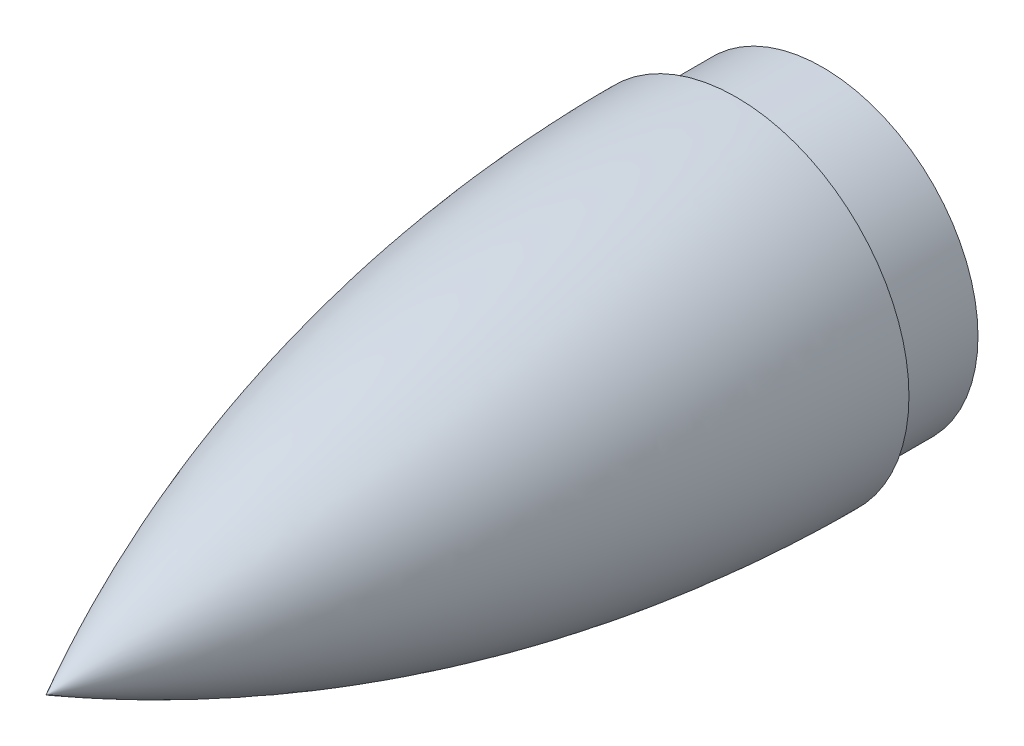
ISO-10303-21;
HEADER;
FILE_DESCRIPTION(('STEP AP214'),'2;1');
FILE_NAME('part.step','',(''),(''),'','','');
FILE_SCHEMA(('AUTOMOTIVE_DESIGN { 1 0 10303 214 1 1 1 1 }'));
ENDSEC;
DATA;
#1=APPLICATION_CONTEXT('core data for automotive mechanical design processes');
#2=APPLICATION_PROTOCOL_DEFINITION('international standard','automotive_design',2000,#1);
#3=PRODUCT_CONTEXT('',#1,'mechanical');
#4=PRODUCT('Part','Part','',(#3));
#5=PRODUCT_RELATED_PRODUCT_CATEGORY('part','',(#4));
#6=PRODUCT_DEFINITION_FORMATION('','',#4);
#7=PRODUCT_DEFINITION_CONTEXT('part definition',#1,'design');
#8=PRODUCT_DEFINITION('design','',#6,#7);
#9=PRODUCT_DEFINITION_SHAPE('','',#8);
#10=(LENGTH_UNIT() NAMED_UNIT(*) SI_UNIT(.MILLI.,.METRE.));
#11=(NAMED_UNIT(*) PLANE_ANGLE_UNIT() SI_UNIT($,.RADIAN.));
#12=(NAMED_UNIT(*) SI_UNIT($,.STERADIAN.) SOLID_ANGLE_UNIT());
#13=UNCERTAINTY_MEASURE_WITH_UNIT(LENGTH_MEASURE(1.E-05),#10,'distance_accuracy_value','');
#14=(GEOMETRIC_REPRESENTATION_CONTEXT(3) GLOBAL_UNCERTAINTY_ASSIGNED_CONTEXT((#13)) GLOBAL_UNIT_ASSIGNED_CONTEXT((#10,
#11,#12)) REPRESENTATION_CONTEXT('',''));
#15=CARTESIAN_POINT('',(0.,0.,0.));
#16=DIRECTION('',(0.,0.,1.));
#17=DIRECTION('',(1.,0.,0.));
#18=AXIS2_PLACEMENT_3D('',#15,#16,#17);
#19=CARTESIAN_POINT('',(0.,20.0000000068402,-80.0000000001834));
#20=CARTESIAN_POINT('',(0.,20.0000080082251,-69.9999999998662));
#21=CARTESIAN_POINT('',(0.,19.3276983793511,-59.999999999594));
#22=CARTESIAN_POINT('',(0.,17.9832749173464,-49.9999999993669));
#23=CARTESIAN_POINT('',(0.,15.951343154723,-39.9999999991857));
#24=CARTESIAN_POINT('',(0.,13.2031305393117,-29.9999999990525));
#25=CARTESIAN_POINT('',(0.,9.6881036925094,-19.9999999989707));
#26=CARTESIAN_POINT('',(0.,5.33331945259236,-9.99999999894512));
#27=CARTESIAN_POINT('',(0.,-5.99320018526001E-10,1.01493032728106E-09));
#28=B_SPLINE_CURVE_WITH_KNOTS('',8,(#19,#20,#21,#22,#23,#24,#25,#26,#27),.UNSPECIFIED.,.F.,.F.,
(9,9),(0.0758715546721221,0.915988323134556),.UNSPECIFIED.);
#29=CARTESIAN_POINT('',(0.,-5.3271970168467E-10,8.90079676629796E-10));
#30=DIRECTION('',(0.,0.,1.));
#31=AXIS1_PLACEMENT('',#29,#30);
#32=SURFACE_OF_REVOLUTION('',#28,#31);
#33=CARTESIAN_POINT('',(0.,-5.3271970168467E-10,8.90079676629796E-10));
#34=VERTEX_POINT('',#33);
#35=VERTEX_LOOP('',#34);
#36=FACE_BOUND('',#35,.T.);
#37=CARTESIAN_POINT('',(0.,-5.3271970168467E-10,-80.0000000002377));
#38=DIRECTION('',(0.,0.,1.));
#39=DIRECTION('',(1.,0.,0.));
#40=AXIS2_PLACEMENT_3D('',#37,#38,#39);
#41=CIRCLE('',#40,20.0000000073729);
#42=CARTESIAN_POINT('',(20.0000000073729,-5.3271970168467E-10,-80.0000000002377));
#43=VERTEX_POINT('',#42);
#44=EDGE_CURVE('E55',#43,#43,#41,.T.);
#45=ORIENTED_EDGE('',*,*,#44,.T.);
#46=EDGE_LOOP('',(#45));
#47=FACE_BOUND('',#46,.T.);
#48=ADVANCED_FACE('F39',(#36,#47),#32,.T.);
#49=CARTESIAN_POINT('',(0.,17.9999999995339,-89.9999999991804));
#50=DIRECTION('',(0.,0.,1.));
#51=DIRECTION('',(1.,0.,0.));
#52=AXIS2_PLACEMENT_3D('',#49,#50,#51);
#53=PLANE('',#52);
#54=CARTESIAN_POINT('',(0.,-5.3271970168467E-10,-89.9999999991804));
#55=DIRECTION('',(0.,0.,1.));
#56=DIRECTION('',(1.,0.,0.));
#57=AXIS2_PLACEMENT_3D('',#54,#55,#56);
#58=CIRCLE('',#57,18.0000000000666);
#59=CARTESIAN_POINT('',(18.0000000000666,-5.3271970168467E-10,-89.9999999991804));
#60=VERTEX_POINT('',#59);
#61=EDGE_CURVE('E11',#60,#60,#58,.T.);
#62=ORIENTED_EDGE('',*,*,#61,.F.);
#63=EDGE_LOOP('',(#62));
#64=FACE_BOUND('',#63,.T.);
#65=ADVANCED_FACE('F52',(#64),#53,.F.);
#66=CARTESIAN_POINT('',(0.,-5.3271970168467E-10,8.90079676629796E-10));
#67=DIRECTION('',(0.,0.,1.));
#68=DIRECTION('',(1.,0.,0.));
#69=AXIS2_PLACEMENT_3D('',#66,#67,#68);
#70=CYLINDRICAL_SURFACE('',#69,18.0000000000666);
#71=CARTESIAN_POINT('',(0.,-5.3271970168467E-10,-80.0000000002377));
#72=DIRECTION('',(0.,0.,1.));
#73=DIRECTION('',(1.,0.,0.));
#74=AXIS2_PLACEMENT_3D('',#71,#72,#73);
#75=CIRCLE('',#74,18.0000000000666);
#76=CARTESIAN_POINT('',(18.0000000000666,-5.3271970168467E-10,-80.0000000002377));
#77=VERTEX_POINT('',#76);
#78=EDGE_CURVE('E47',#77,#77,#75,.T.);
#79=ORIENTED_EDGE('',*,*,#78,.F.);
#80=EDGE_LOOP('',(#79));
#81=FACE_BOUND('',#80,.T.);
#82=ORIENTED_EDGE('',*,*,#61,.T.);
#83=EDGE_LOOP('',(#82));
#84=FACE_BOUND('',#83,.T.);
#85=ADVANCED_FACE('F71',(#81,#84),#70,.T.);
#86=CARTESIAN_POINT('',(0.,20.0000000068402,-80.0000000002377));
#87=DIRECTION('',(0.,0.,1.));
#88=DIRECTION('',(1.,0.,0.));
#89=AXIS2_PLACEMENT_3D('',#86,#87,#88);
#90=PLANE('',#89);
#91=ORIENTED_EDGE('',*,*,#44,.F.);
#92=EDGE_LOOP('',(#91));
#93=FACE_BOUND('',#92,.T.);
#94=ORIENTED_EDGE('',*,*,#78,.T.);
#95=EDGE_LOOP('',(#94));
#96=FACE_BOUND('',#95,.T.);
#97=ADVANCED_FACE('F69',(#93,#96),#90,.F.);
#98=CLOSED_SHELL('',(#48,#65,#85,#97));
#99=MANIFOLD_SOLID_BREP('B2',#98);
#100=ADVANCED_BREP_SHAPE_REPRESENTATION('',(#18,#99),#14);
#101=SHAPE_DEFINITION_REPRESENTATION(#9,#100);
ENDSEC;
END-ISO-10303-21;
